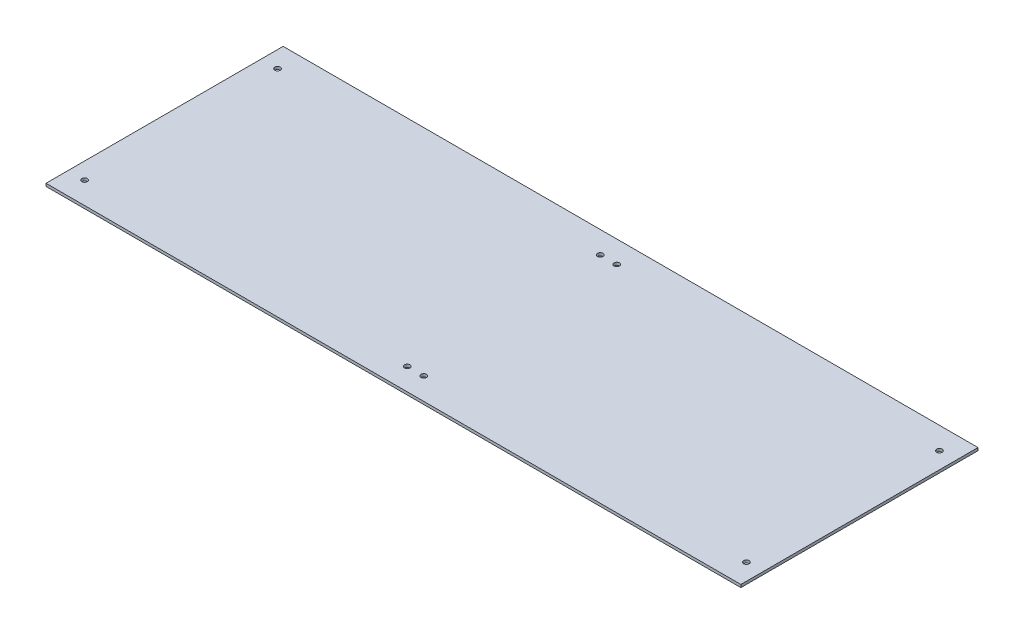
ISO-10303-21;
HEADER;
FILE_DESCRIPTION(('STEP AP214'),'2;1');
FILE_NAME('part.step','',(''),(''),'','','');
FILE_SCHEMA(('AUTOMOTIVE_DESIGN { 1 0 10303 214 1 1 1 1 }'));
ENDSEC;
DATA;
#1=APPLICATION_CONTEXT('core data for automotive mechanical design processes');
#2=APPLICATION_PROTOCOL_DEFINITION('international standard','automotive_design',2000,#1);
#3=PRODUCT_CONTEXT('',#1,'mechanical');
#4=PRODUCT('Part','Part','',(#3));
#5=PRODUCT_RELATED_PRODUCT_CATEGORY('part','',(#4));
#6=PRODUCT_DEFINITION_FORMATION('','',#4);
#7=PRODUCT_DEFINITION_CONTEXT('part definition',#1,'design');
#8=PRODUCT_DEFINITION('design','',#6,#7);
#9=PRODUCT_DEFINITION_SHAPE('','',#8);
#10=(LENGTH_UNIT() NAMED_UNIT(*) SI_UNIT(.MILLI.,.METRE.));
#11=(NAMED_UNIT(*) PLANE_ANGLE_UNIT() SI_UNIT($,.RADIAN.));
#12=(NAMED_UNIT(*) SI_UNIT($,.STERADIAN.) SOLID_ANGLE_UNIT());
#13=UNCERTAINTY_MEASURE_WITH_UNIT(LENGTH_MEASURE(1.E-05),#10,'distance_accuracy_value','');
#14=(GEOMETRIC_REPRESENTATION_CONTEXT(3) GLOBAL_UNCERTAINTY_ASSIGNED_CONTEXT((#13)) GLOBAL_UNIT_ASSIGNED_CONTEXT((#10,
#11,#12)) REPRESENTATION_CONTEXT('',''));
#15=CARTESIAN_POINT('',(0.,0.,0.));
#16=DIRECTION('',(0.,0.,1.));
#17=DIRECTION('',(1.,0.,0.));
#18=AXIS2_PLACEMENT_3D('',#15,#16,#17);
#19=CARTESIAN_POINT('',(0.,3.175,0.));
#20=DIRECTION('',(0.,1.,0.));
#21=DIRECTION('',(0.,0.,1.));
#22=AXIS2_PLACEMENT_3D('',#19,#20,#21);
#23=PLANE('',#22);
#24=CARTESIAN_POINT('',(781.05,3.175,247.65));
#25=DIRECTION('',(0.,1.,0.));
#26=DIRECTION('',(0.,0.,1.));
#27=AXIS2_PLACEMENT_3D('',#24,#25,#26);
#28=CIRCLE('',#27,3.175);
#29=CARTESIAN_POINT('',(781.05,3.175,250.825));
#30=VERTEX_POINT('',#29);
#31=EDGE_CURVE('E104',#30,#30,#28,.F.);
#32=ORIENTED_EDGE('',*,*,#31,.T.);
#33=EDGE_LOOP('',(#32));
#34=FACE_BOUND('',#33,.T.);
#35=CARTESIAN_POINT('',(781.05,3.175,25.4));
#36=DIRECTION('',(0.,1.,0.));
#37=DIRECTION('',(0.,0.,1.));
#38=AXIS2_PLACEMENT_3D('',#35,#36,#37);
#39=CIRCLE('',#38,3.175);
#40=CARTESIAN_POINT('',(781.05,3.175,28.575));
#41=VERTEX_POINT('',#40);
#42=EDGE_CURVE('E107',#41,#41,#39,.F.);
#43=ORIENTED_EDGE('',*,*,#42,.T.);
#44=EDGE_LOOP('',(#43));
#45=FACE_BOUND('',#44,.T.);
#46=CARTESIAN_POINT('',(409.575,3.175,25.4));
#47=DIRECTION('',(0.,1.,0.));
#48=DIRECTION('',(0.,0.,1.));
#49=AXIS2_PLACEMENT_3D('',#46,#47,#48);
#50=CIRCLE('',#49,3.175);
#51=CARTESIAN_POINT('',(409.575,3.175,28.575));
#52=VERTEX_POINT('',#51);
#53=EDGE_CURVE('E110',#52,#52,#50,.F.);
#54=ORIENTED_EDGE('',*,*,#53,.T.);
#55=EDGE_LOOP('',(#54));
#56=FACE_BOUND('',#55,.T.);
#57=CARTESIAN_POINT('',(390.525,3.175,25.4));
#58=DIRECTION('',(0.,1.,0.));
#59=DIRECTION('',(0.,0.,1.));
#60=AXIS2_PLACEMENT_3D('',#57,#58,#59);
#61=CIRCLE('',#60,3.175);
#62=CARTESIAN_POINT('',(390.525,3.175,28.575));
#63=VERTEX_POINT('',#62);
#64=EDGE_CURVE('E113',#63,#63,#61,.F.);
#65=ORIENTED_EDGE('',*,*,#64,.T.);
#66=EDGE_LOOP('',(#65));
#67=FACE_BOUND('',#66,.T.);
#68=CARTESIAN_POINT('',(409.575,3.175,247.65));
#69=DIRECTION('',(0.,1.,0.));
#70=DIRECTION('',(0.,0.,1.));
#71=AXIS2_PLACEMENT_3D('',#68,#69,#70);
#72=CIRCLE('',#71,3.175);
#73=CARTESIAN_POINT('',(409.575,3.175,250.825));
#74=VERTEX_POINT('',#73);
#75=EDGE_CURVE('E116',#74,#74,#72,.F.);
#76=ORIENTED_EDGE('',*,*,#75,.T.);
#77=EDGE_LOOP('',(#76));
#78=FACE_BOUND('',#77,.T.);
#79=CARTESIAN_POINT('',(390.525,3.175,247.65));
#80=DIRECTION('',(0.,1.,0.));
#81=DIRECTION('',(0.,0.,1.));
#82=AXIS2_PLACEMENT_3D('',#79,#80,#81);
#83=CIRCLE('',#82,3.175);
#84=CARTESIAN_POINT('',(390.525,3.175,250.825));
#85=VERTEX_POINT('',#84);
#86=EDGE_CURVE('E119',#85,#85,#83,.F.);
#87=ORIENTED_EDGE('',*,*,#86,.T.);
#88=EDGE_LOOP('',(#87));
#89=FACE_BOUND('',#88,.T.);
#90=CARTESIAN_POINT('',(19.05,3.175,247.65));
#91=DIRECTION('',(0.,1.,0.));
#92=DIRECTION('',(0.,0.,1.));
#93=AXIS2_PLACEMENT_3D('',#90,#91,#92);
#94=CIRCLE('',#93,3.175);
#95=CARTESIAN_POINT('',(19.05,3.175,250.825));
#96=VERTEX_POINT('',#95);
#97=EDGE_CURVE('E121',#96,#96,#94,.F.);
#98=ORIENTED_EDGE('',*,*,#97,.T.);
#99=EDGE_LOOP('',(#98));
#100=FACE_BOUND('',#99,.T.);
#101=CARTESIAN_POINT('',(19.05,3.175,25.4));
#102=DIRECTION('',(0.,1.,0.));
#103=DIRECTION('',(0.,0.,1.));
#104=AXIS2_PLACEMENT_3D('',#101,#102,#103);
#105=CIRCLE('',#104,3.175);
#106=CARTESIAN_POINT('',(19.05,3.175,28.575));
#107=VERTEX_POINT('',#106);
#108=EDGE_CURVE('E20',#107,#107,#105,.F.);
#109=ORIENTED_EDGE('',*,*,#108,.T.);
#110=EDGE_LOOP('',(#109));
#111=FACE_BOUND('',#110,.T.);
#112=DIRECTION('',(-1.,0.,0.));
#113=VECTOR('',#112,1.);
#114=CARTESIAN_POINT('',(800.1,3.175,0.));
#115=LINE('',#114,#113);
#116=CARTESIAN_POINT('',(0.,3.175,0.));
#117=VERTEX_POINT('',#116);
#118=CARTESIAN_POINT('',(800.1,3.175,0.));
#119=VERTEX_POINT('',#118);
#120=EDGE_CURVE('E71',#117,#119,#115,.F.);
#121=ORIENTED_EDGE('',*,*,#120,.F.);
#122=DIRECTION('',(0.,0.,1.));
#123=VECTOR('',#122,1.);
#124=CARTESIAN_POINT('',(0.,3.175,0.));
#125=LINE('',#124,#123);
#126=CARTESIAN_POINT('',(0.,3.175,273.05));
#127=VERTEX_POINT('',#126);
#128=EDGE_CURVE('E68',#127,#117,#125,.F.);
#129=ORIENTED_EDGE('',*,*,#128,.F.);
#130=DIRECTION('',(1.,0.,0.));
#131=VECTOR('',#130,1.);
#132=CARTESIAN_POINT('',(0.,3.175,273.05));
#133=LINE('',#132,#131);
#134=CARTESIAN_POINT('',(800.1,3.175,273.05));
#135=VERTEX_POINT('',#134);
#136=EDGE_CURVE('E59',#135,#127,#133,.F.);
#137=ORIENTED_EDGE('',*,*,#136,.F.);
#138=DIRECTION('',(0.,0.,-1.));
#139=VECTOR('',#138,1.);
#140=CARTESIAN_POINT('',(800.1,3.175,273.05));
#141=LINE('',#140,#139);
#142=EDGE_CURVE('E54',#119,#135,#141,.F.);
#143=ORIENTED_EDGE('',*,*,#142,.F.);
#144=EDGE_LOOP('',(#121,#129,#137,#143));
#145=FACE_BOUND('',#144,.T.);
#146=ADVANCED_FACE('F17',(#34,#45,#56,#67,#78,#89,#100,#111,#145),#23,.T.);
#147=CARTESIAN_POINT('',(0.,0.,0.));
#148=DIRECTION('',(-1.,0.,0.));
#149=DIRECTION('',(0.,0.,1.));
#150=AXIS2_PLACEMENT_3D('',#147,#148,#149);
#151=PLANE('',#150);
#152=DIRECTION('',(0.,1.,0.));
#153=VECTOR('',#152,1.);
#154=CARTESIAN_POINT('',(0.,0.,0.));
#155=LINE('',#154,#153);
#156=CARTESIAN_POINT('',(0.,0.,0.));
#157=VERTEX_POINT('',#156);
#158=EDGE_CURVE('E129',#157,#117,#155,.T.);
#159=ORIENTED_EDGE('',*,*,#158,.F.);
#160=DIRECTION('',(0.,0.,1.));
#161=VECTOR('',#160,1.);
#162=CARTESIAN_POINT('',(0.,0.,0.));
#163=LINE('',#162,#161);
#164=CARTESIAN_POINT('',(0.,0.,273.05));
#165=VERTEX_POINT('',#164);
#166=EDGE_CURVE('E78',#157,#165,#163,.T.);
#167=ORIENTED_EDGE('',*,*,#166,.T.);
#168=DIRECTION('',(0.,1.,0.));
#169=VECTOR('',#168,1.);
#170=CARTESIAN_POINT('',(0.,0.,273.05));
#171=LINE('',#170,#169);
#172=EDGE_CURVE('E64',#127,#165,#171,.F.);
#173=ORIENTED_EDGE('',*,*,#172,.F.);
#174=ORIENTED_EDGE('',*,*,#128,.T.);
#175=EDGE_LOOP('',(#159,#167,#173,#174));
#176=FACE_BOUND('',#175,.T.);
#177=ADVANCED_FACE('F77',(#176),#151,.T.);
#178=CARTESIAN_POINT('',(0.,0.,273.05));
#179=DIRECTION('',(0.,0.,1.));
#180=DIRECTION('',(1.,0.,0.));
#181=AXIS2_PLACEMENT_3D('',#178,#179,#180);
#182=PLANE('',#181);
#183=ORIENTED_EDGE('',*,*,#172,.T.);
#184=DIRECTION('',(1.,0.,0.));
#185=VECTOR('',#184,1.);
#186=CARTESIAN_POINT('',(0.,0.,273.05));
#187=LINE('',#186,#185);
#188=CARTESIAN_POINT('',(800.1,0.,273.05));
#189=VERTEX_POINT('',#188);
#190=EDGE_CURVE('E140',#165,#189,#187,.T.);
#191=ORIENTED_EDGE('',*,*,#190,.T.);
#192=DIRECTION('',(0.,1.,0.));
#193=VECTOR('',#192,1.);
#194=CARTESIAN_POINT('',(800.1,0.,273.05));
#195=LINE('',#194,#193);
#196=EDGE_CURVE('E66',#135,#189,#195,.F.);
#197=ORIENTED_EDGE('',*,*,#196,.F.);
#198=ORIENTED_EDGE('',*,*,#136,.T.);
#199=EDGE_LOOP('',(#183,#191,#197,#198));
#200=FACE_BOUND('',#199,.T.);
#201=ADVANCED_FACE('F61',(#200),#182,.T.);
#202=CARTESIAN_POINT('',(800.1,0.,273.05));
#203=DIRECTION('',(1.,0.,0.));
#204=DIRECTION('',(0.,0.,-1.));
#205=AXIS2_PLACEMENT_3D('',#202,#203,#204);
#206=PLANE('',#205);
#207=ORIENTED_EDGE('',*,*,#196,.T.);
#208=DIRECTION('',(0.,0.,1.));
#209=VECTOR('',#208,1.);
#210=CARTESIAN_POINT('',(800.1,0.,0.));
#211=LINE('',#210,#209);
#212=CARTESIAN_POINT('',(800.1,0.,0.));
#213=VERTEX_POINT('',#212);
#214=EDGE_CURVE('E137',#189,#213,#211,.F.);
#215=ORIENTED_EDGE('',*,*,#214,.T.);
#216=DIRECTION('',(0.,1.,0.));
#217=VECTOR('',#216,1.);
#218=CARTESIAN_POINT('',(800.1,0.,0.));
#219=LINE('',#218,#217);
#220=EDGE_CURVE('E35',#119,#213,#219,.F.);
#221=ORIENTED_EDGE('',*,*,#220,.F.);
#222=ORIENTED_EDGE('',*,*,#142,.T.);
#223=EDGE_LOOP('',(#207,#215,#221,#222));
#224=FACE_BOUND('',#223,.T.);
#225=ADVANCED_FACE('F136',(#224),#206,.T.);
#226=CARTESIAN_POINT('',(800.1,0.,0.));
#227=DIRECTION('',(0.,0.,-1.));
#228=DIRECTION('',(-1.,0.,0.));
#229=AXIS2_PLACEMENT_3D('',#226,#227,#228);
#230=PLANE('',#229);
#231=ORIENTED_EDGE('',*,*,#220,.T.);
#232=DIRECTION('',(1.,0.,0.));
#233=VECTOR('',#232,1.);
#234=CARTESIAN_POINT('',(0.,0.,0.));
#235=LINE('',#234,#233);
#236=EDGE_CURVE('E103',#213,#157,#235,.F.);
#237=ORIENTED_EDGE('',*,*,#236,.T.);
#238=ORIENTED_EDGE('',*,*,#158,.T.);
#239=ORIENTED_EDGE('',*,*,#120,.T.);
#240=EDGE_LOOP('',(#231,#237,#238,#239));
#241=FACE_BOUND('',#240,.T.);
#242=ADVANCED_FACE('F143',(#241),#230,.T.);
#243=CARTESIAN_POINT('',(19.05,3.175,25.4));
#244=DIRECTION('',(0.,1.,0.));
#245=DIRECTION('',(0.,0.,1.));
#246=AXIS2_PLACEMENT_3D('',#243,#244,#245);
#247=CYLINDRICAL_SURFACE('',#246,3.175);
#248=ORIENTED_EDGE('',*,*,#108,.F.);
#249=EDGE_LOOP('',(#248));
#250=FACE_BOUND('',#249,.T.);
#251=CARTESIAN_POINT('',(19.05,0.,25.4));
#252=DIRECTION('',(0.,1.,0.));
#253=DIRECTION('',(0.,0.,1.));
#254=AXIS2_PLACEMENT_3D('',#251,#252,#253);
#255=CIRCLE('',#254,3.175);
#256=CARTESIAN_POINT('',(19.05,0.,28.575));
#257=VERTEX_POINT('',#256);
#258=EDGE_CURVE('E100',#257,#257,#255,.F.);
#259=ORIENTED_EDGE('',*,*,#258,.T.);
#260=EDGE_LOOP('',(#259));
#261=FACE_BOUND('',#260,.T.);
#262=ADVANCED_FACE('F145',(#250,#261),#247,.F.);
#263=CARTESIAN_POINT('',(19.05,3.175,247.65));
#264=DIRECTION('',(0.,1.,0.));
#265=DIRECTION('',(0.,0.,1.));
#266=AXIS2_PLACEMENT_3D('',#263,#264,#265);
#267=CYLINDRICAL_SURFACE('',#266,3.175);
#268=ORIENTED_EDGE('',*,*,#97,.F.);
#269=EDGE_LOOP('',(#268));
#270=FACE_BOUND('',#269,.T.);
#271=CARTESIAN_POINT('',(19.05,0.,247.65));
#272=DIRECTION('',(0.,1.,0.));
#273=DIRECTION('',(0.,0.,1.));
#274=AXIS2_PLACEMENT_3D('',#271,#272,#273);
#275=CIRCLE('',#274,3.175);
#276=CARTESIAN_POINT('',(19.05,0.,250.825));
#277=VERTEX_POINT('',#276);
#278=EDGE_CURVE('E97',#277,#277,#275,.F.);
#279=ORIENTED_EDGE('',*,*,#278,.T.);
#280=EDGE_LOOP('',(#279));
#281=FACE_BOUND('',#280,.T.);
#282=ADVANCED_FACE('F152',(#270,#281),#267,.F.);
#283=CARTESIAN_POINT('',(390.525,3.175,247.65));
#284=DIRECTION('',(0.,1.,0.));
#285=DIRECTION('',(0.,0.,1.));
#286=AXIS2_PLACEMENT_3D('',#283,#284,#285);
#287=CYLINDRICAL_SURFACE('',#286,3.175);
#288=ORIENTED_EDGE('',*,*,#86,.F.);
#289=EDGE_LOOP('',(#288));
#290=FACE_BOUND('',#289,.T.);
#291=CARTESIAN_POINT('',(390.525,0.,247.65));
#292=DIRECTION('',(0.,1.,0.));
#293=DIRECTION('',(0.,0.,1.));
#294=AXIS2_PLACEMENT_3D('',#291,#292,#293);
#295=CIRCLE('',#294,3.175);
#296=CARTESIAN_POINT('',(390.525,0.,250.825));
#297=VERTEX_POINT('',#296);
#298=EDGE_CURVE('E94',#297,#297,#295,.F.);
#299=ORIENTED_EDGE('',*,*,#298,.T.);
#300=EDGE_LOOP('',(#299));
#301=FACE_BOUND('',#300,.T.);
#302=ADVANCED_FACE('F183',(#290,#301),#287,.F.);
#303=CARTESIAN_POINT('',(409.575,3.175,247.65));
#304=DIRECTION('',(0.,1.,0.));
#305=DIRECTION('',(0.,0.,1.));
#306=AXIS2_PLACEMENT_3D('',#303,#304,#305);
#307=CYLINDRICAL_SURFACE('',#306,3.175);
#308=ORIENTED_EDGE('',*,*,#75,.F.);
#309=EDGE_LOOP('',(#308));
#310=FACE_BOUND('',#309,.T.);
#311=CARTESIAN_POINT('',(409.575,0.,247.65));
#312=DIRECTION('',(0.,1.,0.));
#313=DIRECTION('',(0.,0.,1.));
#314=AXIS2_PLACEMENT_3D('',#311,#312,#313);
#315=CIRCLE('',#314,3.175);
#316=CARTESIAN_POINT('',(409.575,0.,250.825));
#317=VERTEX_POINT('',#316);
#318=EDGE_CURVE('E91',#317,#317,#315,.F.);
#319=ORIENTED_EDGE('',*,*,#318,.T.);
#320=EDGE_LOOP('',(#319));
#321=FACE_BOUND('',#320,.T.);
#322=ADVANCED_FACE('F179',(#310,#321),#307,.F.);
#323=CARTESIAN_POINT('',(390.525,3.175,25.4));
#324=DIRECTION('',(0.,1.,0.));
#325=DIRECTION('',(0.,0.,1.));
#326=AXIS2_PLACEMENT_3D('',#323,#324,#325);
#327=CYLINDRICAL_SURFACE('',#326,3.175);
#328=ORIENTED_EDGE('',*,*,#64,.F.);
#329=EDGE_LOOP('',(#328));
#330=FACE_BOUND('',#329,.T.);
#331=CARTESIAN_POINT('',(390.525,0.,25.4));
#332=DIRECTION('',(0.,1.,0.));
#333=DIRECTION('',(0.,0.,1.));
#334=AXIS2_PLACEMENT_3D('',#331,#332,#333);
#335=CIRCLE('',#334,3.175);
#336=CARTESIAN_POINT('',(390.525,0.,28.575));
#337=VERTEX_POINT('',#336);
#338=EDGE_CURVE('E88',#337,#337,#335,.F.);
#339=ORIENTED_EDGE('',*,*,#338,.T.);
#340=EDGE_LOOP('',(#339));
#341=FACE_BOUND('',#340,.T.);
#342=ADVANCED_FACE('F175',(#330,#341),#327,.F.);
#343=CARTESIAN_POINT('',(409.575,3.175,25.4));
#344=DIRECTION('',(0.,1.,0.));
#345=DIRECTION('',(0.,0.,1.));
#346=AXIS2_PLACEMENT_3D('',#343,#344,#345);
#347=CYLINDRICAL_SURFACE('',#346,3.175);
#348=ORIENTED_EDGE('',*,*,#53,.F.);
#349=EDGE_LOOP('',(#348));
#350=FACE_BOUND('',#349,.T.);
#351=CARTESIAN_POINT('',(409.575,0.,25.4));
#352=DIRECTION('',(0.,1.,0.));
#353=DIRECTION('',(0.,0.,1.));
#354=AXIS2_PLACEMENT_3D('',#351,#352,#353);
#355=CIRCLE('',#354,3.175);
#356=CARTESIAN_POINT('',(409.575,0.,28.575));
#357=VERTEX_POINT('',#356);
#358=EDGE_CURVE('E85',#357,#357,#355,.F.);
#359=ORIENTED_EDGE('',*,*,#358,.T.);
#360=EDGE_LOOP('',(#359));
#361=FACE_BOUND('',#360,.T.);
#362=ADVANCED_FACE('F171',(#350,#361),#347,.F.);
#363=CARTESIAN_POINT('',(781.05,3.175,25.4));
#364=DIRECTION('',(0.,1.,0.));
#365=DIRECTION('',(0.,0.,1.));
#366=AXIS2_PLACEMENT_3D('',#363,#364,#365);
#367=CYLINDRICAL_SURFACE('',#366,3.175);
#368=ORIENTED_EDGE('',*,*,#42,.F.);
#369=EDGE_LOOP('',(#368));
#370=FACE_BOUND('',#369,.T.);
#371=CARTESIAN_POINT('',(781.05,0.,25.4));
#372=DIRECTION('',(0.,1.,0.));
#373=DIRECTION('',(0.,0.,1.));
#374=AXIS2_PLACEMENT_3D('',#371,#372,#373);
#375=CIRCLE('',#374,3.175);
#376=CARTESIAN_POINT('',(781.05,0.,28.575));
#377=VERTEX_POINT('',#376);
#378=EDGE_CURVE('E26',#377,#377,#375,.F.);
#379=ORIENTED_EDGE('',*,*,#378,.T.);
#380=EDGE_LOOP('',(#379));
#381=FACE_BOUND('',#380,.T.);
#382=ADVANCED_FACE('F163',(#370,#381),#367,.F.);
#383=CARTESIAN_POINT('',(781.05,3.175,247.65));
#384=DIRECTION('',(0.,1.,0.));
#385=DIRECTION('',(0.,0.,1.));
#386=AXIS2_PLACEMENT_3D('',#383,#384,#385);
#387=CYLINDRICAL_SURFACE('',#386,3.175);
#388=ORIENTED_EDGE('',*,*,#31,.F.);
#389=EDGE_LOOP('',(#388));
#390=FACE_BOUND('',#389,.T.);
#391=CARTESIAN_POINT('',(781.05,0.,247.65));
#392=DIRECTION('',(0.,1.,0.));
#393=DIRECTION('',(0.,0.,1.));
#394=AXIS2_PLACEMENT_3D('',#391,#392,#393);
#395=CIRCLE('',#394,3.175);
#396=CARTESIAN_POINT('',(781.05,0.,250.825));
#397=VERTEX_POINT('',#396);
#398=EDGE_CURVE('E11',#397,#397,#395,.F.);
#399=ORIENTED_EDGE('',*,*,#398,.T.);
#400=EDGE_LOOP('',(#399));
#401=FACE_BOUND('',#400,.T.);
#402=ADVANCED_FACE('F157',(#390,#401),#387,.F.);
#403=CARTESIAN_POINT('',(0.,0.,0.));
#404=DIRECTION('',(0.,1.,0.));
#405=DIRECTION('',(0.,0.,1.));
#406=AXIS2_PLACEMENT_3D('',#403,#404,#405);
#407=PLANE('',#406);
#408=ORIENTED_EDGE('',*,*,#398,.F.);
#409=EDGE_LOOP('',(#408));
#410=FACE_BOUND('',#409,.T.);
#411=ORIENTED_EDGE('',*,*,#378,.F.);
#412=EDGE_LOOP('',(#411));
#413=FACE_BOUND('',#412,.T.);
#414=ORIENTED_EDGE('',*,*,#358,.F.);
#415=EDGE_LOOP('',(#414));
#416=FACE_BOUND('',#415,.T.);
#417=ORIENTED_EDGE('',*,*,#338,.F.);
#418=EDGE_LOOP('',(#417));
#419=FACE_BOUND('',#418,.T.);
#420=ORIENTED_EDGE('',*,*,#318,.F.);
#421=EDGE_LOOP('',(#420));
#422=FACE_BOUND('',#421,.T.);
#423=ORIENTED_EDGE('',*,*,#298,.F.);
#424=EDGE_LOOP('',(#423));
#425=FACE_BOUND('',#424,.T.);
#426=ORIENTED_EDGE('',*,*,#278,.F.);
#427=EDGE_LOOP('',(#426));
#428=FACE_BOUND('',#427,.T.);
#429=ORIENTED_EDGE('',*,*,#258,.F.);
#430=EDGE_LOOP('',(#429));
#431=FACE_BOUND('',#430,.T.);
#432=ORIENTED_EDGE('',*,*,#214,.F.);
#433=ORIENTED_EDGE('',*,*,#190,.F.);
#434=ORIENTED_EDGE('',*,*,#166,.F.);
#435=ORIENTED_EDGE('',*,*,#236,.F.);
#436=EDGE_LOOP('',(#432,#433,#434,#435));
#437=FACE_BOUND('',#436,.T.);
#438=ADVANCED_FACE('F139',(#410,#413,#416,#419,#422,#425,#428,#431,#437),#407,.F.);
#439=CLOSED_SHELL('',(#146,#177,#201,#225,#242,#262,#282,#302,#322,#342,#362,#382,#402,#438));
#440=MANIFOLD_SOLID_BREP('B1',#439);
#441=ADVANCED_BREP_SHAPE_REPRESENTATION('',(#18,#440),#14);
#442=SHAPE_DEFINITION_REPRESENTATION(#9,#441);
ENDSEC;
END-ISO-10303-21;
